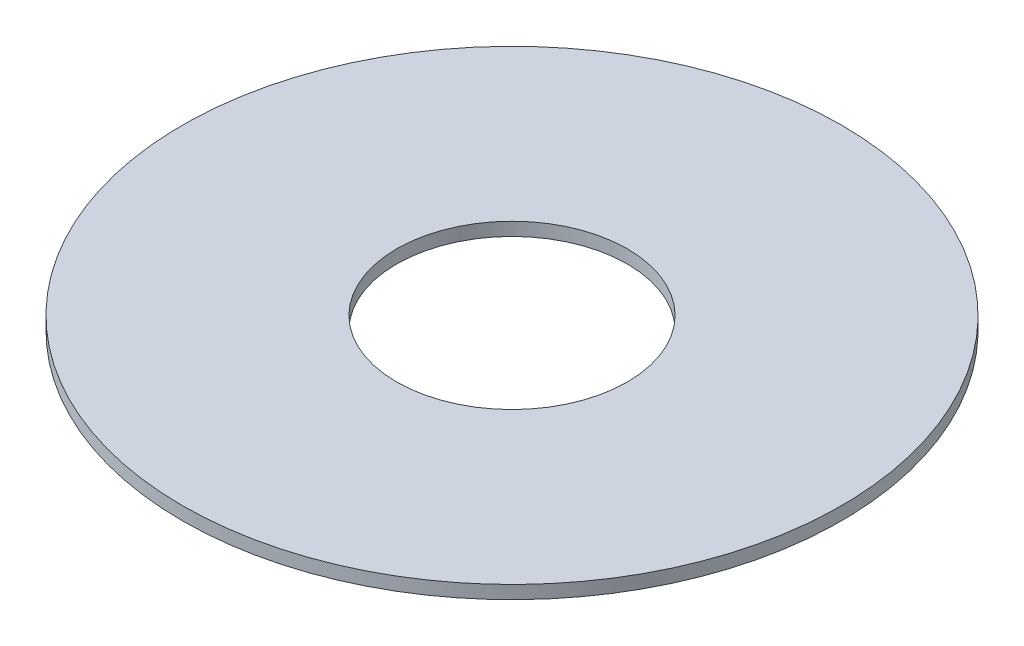
ISO-10303-21;
HEADER;
FILE_DESCRIPTION(('STEP AP214'),'2;1');
FILE_NAME('part.step','',(''),(''),'','','');
FILE_SCHEMA(('AUTOMOTIVE_DESIGN { 1 0 10303 214 1 1 1 1 }'));
ENDSEC;
DATA;
#1=APPLICATION_CONTEXT('core data for automotive mechanical design processes');
#2=APPLICATION_PROTOCOL_DEFINITION('international standard','automotive_design',2000,#1);
#3=PRODUCT_CONTEXT('',#1,'mechanical');
#4=PRODUCT('Part','Part','',(#3));
#5=PRODUCT_RELATED_PRODUCT_CATEGORY('part','',(#4));
#6=PRODUCT_DEFINITION_FORMATION('','',#4);
#7=PRODUCT_DEFINITION_CONTEXT('part definition',#1,'design');
#8=PRODUCT_DEFINITION('design','',#6,#7);
#9=PRODUCT_DEFINITION_SHAPE('','',#8);
#10=(LENGTH_UNIT() NAMED_UNIT(*) SI_UNIT(.MILLI.,.METRE.));
#11=(NAMED_UNIT(*) PLANE_ANGLE_UNIT() SI_UNIT($,.RADIAN.));
#12=(NAMED_UNIT(*) SI_UNIT($,.STERADIAN.) SOLID_ANGLE_UNIT());
#13=UNCERTAINTY_MEASURE_WITH_UNIT(LENGTH_MEASURE(1.E-05),#10,'distance_accuracy_value','');
#14=(GEOMETRIC_REPRESENTATION_CONTEXT(3) GLOBAL_UNCERTAINTY_ASSIGNED_CONTEXT((#13)) GLOBAL_UNIT_ASSIGNED_CONTEXT((#10,
#11,#12)) REPRESENTATION_CONTEXT('',''));
#15=CARTESIAN_POINT('',(0.,0.,0.));
#16=DIRECTION('',(0.,0.,1.));
#17=DIRECTION('',(1.,0.,0.));
#18=AXIS2_PLACEMENT_3D('',#15,#16,#17);
#19=CARTESIAN_POINT('',(0.,4.,0.));
#20=DIRECTION('',(0.,-1.,0.));
#21=DIRECTION('',(0.,0.,-1.));
#22=AXIS2_PLACEMENT_3D('',#19,#20,#21);
#23=CYLINDRICAL_SURFACE('',#22,100.);
#24=CARTESIAN_POINT('',(0.,4.,0.));
#25=DIRECTION('',(0.,1.,0.));
#26=DIRECTION('',(0.,0.,1.));
#27=AXIS2_PLACEMENT_3D('',#24,#25,#26);
#28=CIRCLE('',#27,100.);
#29=CARTESIAN_POINT('',(0.,4.,100.));
#30=VERTEX_POINT('',#29);
#31=EDGE_CURVE('E10',#30,#30,#28,.T.);
#32=ORIENTED_EDGE('',*,*,#31,.F.);
#33=EDGE_LOOP('',(#32));
#34=FACE_BOUND('',#33,.T.);
#35=CARTESIAN_POINT('',(0.,0.,0.));
#36=DIRECTION('',(0.,1.,0.));
#37=DIRECTION('',(0.,0.,1.));
#38=AXIS2_PLACEMENT_3D('',#35,#36,#37);
#39=CIRCLE('',#38,100.);
#40=CARTESIAN_POINT('',(0.,0.,100.));
#41=VERTEX_POINT('',#40);
#42=EDGE_CURVE('E37',#41,#41,#39,.T.);
#43=ORIENTED_EDGE('',*,*,#42,.T.);
#44=EDGE_LOOP('',(#43));
#45=FACE_BOUND('',#44,.T.);
#46=ADVANCED_FACE('F40',(#34,#45),#23,.T.);
#47=CARTESIAN_POINT('',(0.,4.,0.));
#48=DIRECTION('',(0.,1.,0.));
#49=DIRECTION('',(0.,0.,1.));
#50=AXIS2_PLACEMENT_3D('',#47,#48,#49);
#51=PLANE('',#50);
#52=CARTESIAN_POINT('',(0.,4.,0.));
#53=DIRECTION('',(0.,1.,0.));
#54=DIRECTION('',(0.,0.,1.));
#55=AXIS2_PLACEMENT_3D('',#52,#53,#54);
#56=CIRCLE('',#55,35.);
#57=CARTESIAN_POINT('',(0.,4.,35.));
#58=VERTEX_POINT('',#57);
#59=EDGE_CURVE('E50',#58,#58,#56,.T.);
#60=ORIENTED_EDGE('',*,*,#59,.F.);
#61=EDGE_LOOP('',(#60));
#62=FACE_BOUND('',#61,.T.);
#63=ORIENTED_EDGE('',*,*,#31,.T.);
#64=EDGE_LOOP('',(#63));
#65=FACE_BOUND('',#64,.T.);
#66=ADVANCED_FACE('F59',(#62,#65),#51,.T.);
#67=CARTESIAN_POINT('',(0.,0.,0.));
#68=DIRECTION('',(0.,1.,0.));
#69=DIRECTION('',(0.,0.,1.));
#70=AXIS2_PLACEMENT_3D('',#67,#68,#69);
#71=PLANE('',#70);
#72=CARTESIAN_POINT('',(0.,0.,0.));
#73=DIRECTION('',(0.,1.,0.));
#74=DIRECTION('',(0.,0.,1.));
#75=AXIS2_PLACEMENT_3D('',#72,#73,#74);
#76=CIRCLE('',#75,35.);
#77=CARTESIAN_POINT('',(0.,0.,35.));
#78=VERTEX_POINT('',#77);
#79=EDGE_CURVE('E47',#78,#78,#76,.T.);
#80=ORIENTED_EDGE('',*,*,#79,.T.);
#81=EDGE_LOOP('',(#80));
#82=FACE_BOUND('',#81,.T.);
#83=ORIENTED_EDGE('',*,*,#42,.F.);
#84=EDGE_LOOP('',(#83));
#85=FACE_BOUND('',#84,.T.);
#86=ADVANCED_FACE('F58',(#82,#85),#71,.F.);
#87=CARTESIAN_POINT('',(0.,4.,0.));
#88=DIRECTION('',(0.,-1.,0.));
#89=DIRECTION('',(0.,0.,-1.));
#90=AXIS2_PLACEMENT_3D('',#87,#88,#89);
#91=CYLINDRICAL_SURFACE('',#90,35.);
#92=ORIENTED_EDGE('',*,*,#59,.T.);
#93=EDGE_LOOP('',(#92));
#94=FACE_BOUND('',#93,.T.);
#95=ORIENTED_EDGE('',*,*,#79,.F.);
#96=EDGE_LOOP('',(#95));
#97=FACE_BOUND('',#96,.T.);
#98=ADVANCED_FACE('F54',(#94,#97),#91,.F.);
#99=CLOSED_SHELL('',(#46,#66,#86,#98));
#100=MANIFOLD_SOLID_BREP('B2',#99);
#101=ADVANCED_BREP_SHAPE_REPRESENTATION('',(#18,#100),#14);
#102=SHAPE_DEFINITION_REPRESENTATION(#9,#101);
ENDSEC;
END-ISO-10303-21;
